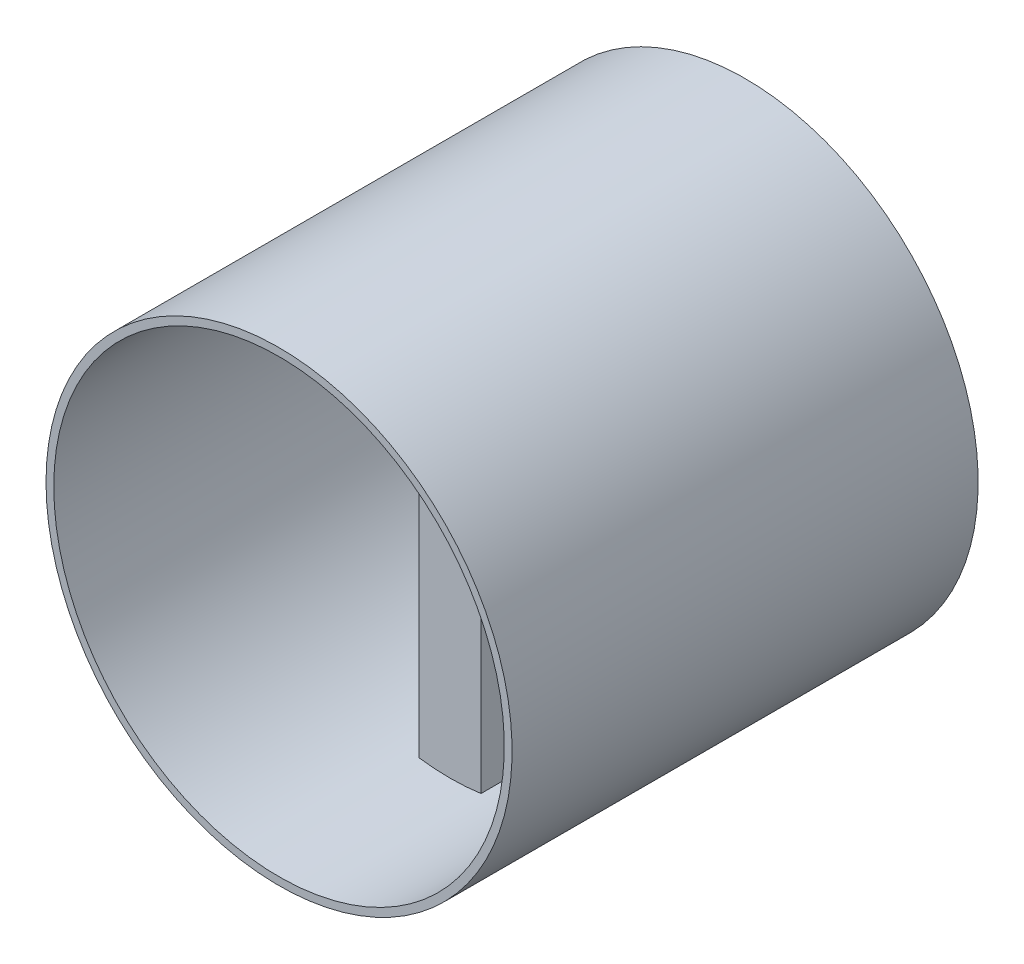
ISO-10303-21;
HEADER;
FILE_DESCRIPTION(('STEP AP214'),'2;1');
FILE_NAME('part.step','',(''),(''),'','','');
FILE_SCHEMA(('AUTOMOTIVE_DESIGN { 1 0 10303 214 1 1 1 1 }'));
ENDSEC;
DATA;
#1=APPLICATION_CONTEXT('core data for automotive mechanical design processes');
#2=APPLICATION_PROTOCOL_DEFINITION('international standard','automotive_design',2000,#1);
#3=PRODUCT_CONTEXT('',#1,'mechanical');
#4=PRODUCT('Part','Part','',(#3));
#5=PRODUCT_RELATED_PRODUCT_CATEGORY('part','',(#4));
#6=PRODUCT_DEFINITION_FORMATION('','',#4);
#7=PRODUCT_DEFINITION_CONTEXT('part definition',#1,'design');
#8=PRODUCT_DEFINITION('design','',#6,#7);
#9=PRODUCT_DEFINITION_SHAPE('','',#8);
#10=(LENGTH_UNIT() NAMED_UNIT(*) SI_UNIT(.MILLI.,.METRE.));
#11=(NAMED_UNIT(*) PLANE_ANGLE_UNIT() SI_UNIT($,.RADIAN.));
#12=(NAMED_UNIT(*) SI_UNIT($,.STERADIAN.) SOLID_ANGLE_UNIT());
#13=UNCERTAINTY_MEASURE_WITH_UNIT(LENGTH_MEASURE(1.E-05),#10,'distance_accuracy_value','');
#14=(GEOMETRIC_REPRESENTATION_CONTEXT(3) GLOBAL_UNCERTAINTY_ASSIGNED_CONTEXT((#13)) GLOBAL_UNIT_ASSIGNED_CONTEXT((#10,
#11,#12)) REPRESENTATION_CONTEXT('',''));
#15=CARTESIAN_POINT('',(0.,0.,0.));
#16=DIRECTION('',(0.,0.,1.));
#17=DIRECTION('',(1.,0.,0.));
#18=AXIS2_PLACEMENT_3D('',#15,#16,#17);
#19=CARTESIAN_POINT('',(0.,0.,60.));
#20=DIRECTION('',(1.,0.,0.));
#21=DIRECTION('',(0.,0.,-1.));
#22=AXIS2_PLACEMENT_3D('',#19,#20,#21);
#23=PLANE('',#22);
#24=DIRECTION('',(0.,-1.,0.));
#25=VECTOR('',#24,1.);
#26=CARTESIAN_POINT('',(0.,0.,38.));
#27=LINE('',#26,#25);
#28=CARTESIAN_POINT('',(0.,58.2228132326902,38.));
#29=VERTEX_POINT('',#28);
#30=CARTESIAN_POINT('',(0.,0.77718676730985,38.));
#31=VERTEX_POINT('',#30);
#32=EDGE_CURVE('E134',#29,#31,#27,.T.);
#33=ORIENTED_EDGE('',*,*,#32,.F.);
#34=DIRECTION('',(0.,0.,-1.));
#35=VECTOR('',#34,1.);
#36=CARTESIAN_POINT('',(0.,58.2228132326901,60.));
#37=LINE('',#36,#35);
#38=CARTESIAN_POINT('',(0.,58.2228132326901,30.));
#39=VERTEX_POINT('',#38);
#40=EDGE_CURVE('E44',#39,#29,#37,.F.);
#41=ORIENTED_EDGE('',*,*,#40,.F.);
#42=DIRECTION('',(0.,1.,0.));
#43=VECTOR('',#42,1.);
#44=CARTESIAN_POINT('',(0.,0.,30.));
#45=LINE('',#44,#43);
#46=CARTESIAN_POINT('',(0.,0.77718676730985,30.));
#47=VERTEX_POINT('',#46);
#48=EDGE_CURVE('E162',#47,#39,#45,.T.);
#49=ORIENTED_EDGE('',*,*,#48,.F.);
#50=DIRECTION('',(0.,0.,-1.));
#51=VECTOR('',#50,1.);
#52=CARTESIAN_POINT('',(0.,0.77718676730985,60.));
#53=LINE('',#52,#51);
#54=EDGE_CURVE('E11',#31,#47,#53,.T.);
#55=ORIENTED_EDGE('',*,*,#54,.F.);
#56=EDGE_LOOP('',(#33,#41,#49,#55));
#57=FACE_BOUND('',#56,.T.);
#58=ADVANCED_FACE('F37',(#57),#23,.F.);
#59=CARTESIAN_POINT('',(8.,0.,60.));
#60=DIRECTION('',(-1.,0.,0.));
#61=DIRECTION('',(0.,-1.,0.));
#62=AXIS2_PLACEMENT_3D('',#59,#60,#61);
#63=PLANE('',#62);
#64=DIRECTION('',(0.,1.,0.));
#65=VECTOR('',#64,1.);
#66=CARTESIAN_POINT('',(8.,0.,38.));
#67=LINE('',#66,#65);
#68=CARTESIAN_POINT('',(8.,0.77718676730985,38.));
#69=VERTEX_POINT('',#68);
#70=CARTESIAN_POINT('',(7.99999999999999,58.2228132326902,38.));
#71=VERTEX_POINT('',#70);
#72=EDGE_CURVE('E124',#69,#71,#67,.T.);
#73=ORIENTED_EDGE('',*,*,#72,.F.);
#74=DIRECTION('',(0.,0.,-1.));
#75=VECTOR('',#74,1.);
#76=CARTESIAN_POINT('',(8.,0.77718676730985,60.));
#77=LINE('',#76,#75);
#78=CARTESIAN_POINT('',(8.,0.77718676730985,30.));
#79=VERTEX_POINT('',#78);
#80=EDGE_CURVE('E148',#79,#69,#77,.F.);
#81=ORIENTED_EDGE('',*,*,#80,.F.);
#82=DIRECTION('',(0.,-1.,0.));
#83=VECTOR('',#82,1.);
#84=CARTESIAN_POINT('',(8.,0.,30.));
#85=LINE('',#84,#83);
#86=CARTESIAN_POINT('',(7.99999999999999,58.2228132326901,30.));
#87=VERTEX_POINT('',#86);
#88=EDGE_CURVE('E147',#87,#79,#85,.T.);
#89=ORIENTED_EDGE('',*,*,#88,.F.);
#90=DIRECTION('',(0.,0.,-1.));
#91=VECTOR('',#90,1.);
#92=CARTESIAN_POINT('',(7.99999999999999,58.2228132326901,60.));
#93=LINE('',#92,#91);
#94=EDGE_CURVE('E141',#71,#87,#93,.T.);
#95=ORIENTED_EDGE('',*,*,#94,.F.);
#96=EDGE_LOOP('',(#73,#81,#89,#95));
#97=FACE_BOUND('',#96,.T.);
#98=ADVANCED_FACE('F146',(#97),#63,.F.);
#99=CARTESIAN_POINT('',(0.,0.,60.));
#100=DIRECTION('',(0.,0.,-1.));
#101=DIRECTION('',(-1.,0.,0.));
#102=AXIS2_PLACEMENT_3D('',#99,#100,#101);
#103=PLANE('',#102);
#104=CARTESIAN_POINT('',(4.,29.5,60.));
#105=DIRECTION('',(0.,0.,-1.));
#106=DIRECTION('',(-1.,0.,0.));
#107=AXIS2_PLACEMENT_3D('',#104,#105,#106);
#108=CIRCLE('',#107,29.);
#109=CARTESIAN_POINT('',(-25.,29.5,60.));
#110=VERTEX_POINT('',#109);
#111=EDGE_CURVE('E156',#110,#110,#108,.T.);
#112=ORIENTED_EDGE('',*,*,#111,.T.);
#113=EDGE_LOOP('',(#112));
#114=FACE_BOUND('',#113,.T.);
#115=CARTESIAN_POINT('',(4.,29.5,60.));
#116=DIRECTION('',(0.,0.,-1.));
#117=DIRECTION('',(-1.,0.,0.));
#118=AXIS2_PLACEMENT_3D('',#115,#116,#117);
#119=CIRCLE('',#118,30.);
#120=CARTESIAN_POINT('',(-26.,29.5,60.));
#121=VERTEX_POINT('',#120);
#122=EDGE_CURVE('E150',#121,#121,#119,.T.);
#123=ORIENTED_EDGE('',*,*,#122,.F.);
#124=EDGE_LOOP('',(#123));
#125=FACE_BOUND('',#124,.T.);
#126=ADVANCED_FACE('F297',(#114,#125),#103,.F.);
#127=CARTESIAN_POINT('',(0.,0.,0.));
#128=DIRECTION('',(0.,0.,-1.));
#129=DIRECTION('',(-1.,0.,0.));
#130=AXIS2_PLACEMENT_3D('',#127,#128,#129);
#131=PLANE('',#130);
#132=CARTESIAN_POINT('',(4.,29.5,0.));
#133=DIRECTION('',(0.,0.,-1.));
#134=DIRECTION('',(-1.,0.,0.));
#135=AXIS2_PLACEMENT_3D('',#132,#133,#134);
#136=CIRCLE('',#135,29.);
#137=CARTESIAN_POINT('',(-25.,29.5,0.));
#138=VERTEX_POINT('',#137);
#139=EDGE_CURVE('E159',#138,#138,#136,.T.);
#140=ORIENTED_EDGE('',*,*,#139,.F.);
#141=EDGE_LOOP('',(#140));
#142=FACE_BOUND('',#141,.T.);
#143=CARTESIAN_POINT('',(4.,29.5,0.));
#144=DIRECTION('',(0.,0.,-1.));
#145=DIRECTION('',(-1.,0.,0.));
#146=AXIS2_PLACEMENT_3D('',#143,#144,#145);
#147=CIRCLE('',#146,30.);
#148=CARTESIAN_POINT('',(-26.,29.5,0.));
#149=VERTEX_POINT('',#148);
#150=EDGE_CURVE('E153',#149,#149,#147,.T.);
#151=ORIENTED_EDGE('',*,*,#150,.T.);
#152=EDGE_LOOP('',(#151));
#153=FACE_BOUND('',#152,.T.);
#154=ADVANCED_FACE('F312',(#142,#153),#131,.T.);
#155=CARTESIAN_POINT('',(4.,29.5,60.));
#156=DIRECTION('',(0.,0.,-1.));
#157=DIRECTION('',(-1.,0.,0.));
#158=AXIS2_PLACEMENT_3D('',#155,#156,#157);
#159=CYLINDRICAL_SURFACE('',#158,29.);
#160=ORIENTED_EDGE('',*,*,#111,.F.);
#161=EDGE_LOOP('',(#160));
#162=FACE_BOUND('',#161,.T.);
#163=CARTESIAN_POINT('',(4.,29.5,38.));
#164=DIRECTION('',(0.,0.,1.));
#165=DIRECTION('',(1.,0.,0.));
#166=AXIS2_PLACEMENT_3D('',#163,#164,#165);
#167=CIRCLE('',#166,29.);
#168=EDGE_CURVE('E129',#31,#69,#167,.T.);
#169=ORIENTED_EDGE('',*,*,#168,.F.);
#170=ORIENTED_EDGE('',*,*,#54,.T.);
#171=CARTESIAN_POINT('',(4.,29.5,30.));
#172=DIRECTION('',(0.,0.,-1.));
#173=DIRECTION('',(-1.,0.,0.));
#174=AXIS2_PLACEMENT_3D('',#171,#172,#173);
#175=CIRCLE('',#174,29.);
#176=EDGE_CURVE('E169',#79,#47,#175,.T.);
#177=ORIENTED_EDGE('',*,*,#176,.F.);
#178=ORIENTED_EDGE('',*,*,#80,.T.);
#179=EDGE_LOOP('',(#169,#170,#177,#178));
#180=FACE_BOUND('',#179,.T.);
#181=ORIENTED_EDGE('',*,*,#40,.T.);
#182=EDGE_CURVE('E127',#71,#29,#167,.T.);
#183=ORIENTED_EDGE('',*,*,#182,.F.);
#184=ORIENTED_EDGE('',*,*,#94,.T.);
#185=EDGE_CURVE('E167',#39,#87,#175,.T.);
#186=ORIENTED_EDGE('',*,*,#185,.F.);
#187=EDGE_LOOP('',(#181,#183,#184,#186));
#188=FACE_BOUND('',#187,.T.);
#189=ORIENTED_EDGE('',*,*,#139,.T.);
#190=EDGE_LOOP('',(#189));
#191=FACE_BOUND('',#190,.T.);
#192=ADVANCED_FACE('F138',(#162,#180,#188,#191),#159,.F.);
#193=CARTESIAN_POINT('',(4.,29.5,60.));
#194=DIRECTION('',(0.,0.,-1.));
#195=DIRECTION('',(-1.,0.,0.));
#196=AXIS2_PLACEMENT_3D('',#193,#194,#195);
#197=CYLINDRICAL_SURFACE('',#196,30.);
#198=ORIENTED_EDGE('',*,*,#122,.T.);
#199=EDGE_LOOP('',(#198));
#200=FACE_BOUND('',#199,.T.);
#201=ORIENTED_EDGE('',*,*,#150,.F.);
#202=EDGE_LOOP('',(#201));
#203=FACE_BOUND('',#202,.T.);
#204=ADVANCED_FACE('F300',(#200,#203),#197,.T.);
#205=CARTESIAN_POINT('',(4.,29.5,30.));
#206=DIRECTION('',(0.,0.,-1.));
#207=DIRECTION('',(-1.,0.,0.));
#208=AXIS2_PLACEMENT_3D('',#205,#206,#207);
#209=PLANE('',#208);
#210=CARTESIAN_POINT('',(4.,29.5,30.));
#211=DIRECTION('',(0.,0.,-1.));
#212=DIRECTION('',(-1.,0.,0.));
#213=AXIS2_PLACEMENT_3D('',#210,#211,#212);
#214=CIRCLE('',#213,3.);
#215=CARTESIAN_POINT('',(6.96725784447476,29.9420190995907,30.));
#216=VERTEX_POINT('',#215);
#217=CARTESIAN_POINT('',(6.96725784447476,29.0579809004093,30.));
#218=VERTEX_POINT('',#217);
#219=EDGE_CURVE('E51',#216,#218,#214,.T.);
#220=ORIENTED_EDGE('',*,*,#219,.F.);
#221=DIRECTION('',(0.0738716855153117,-0.997267754456709,0.));
#222=VECTOR('',#221,1.);
#223=CARTESIAN_POINT('',(6.,43.,30.));
#224=LINE('',#223,#222);
#225=CARTESIAN_POINT('',(6.,43.,30.));
#226=VERTEX_POINT('',#225);
#227=EDGE_CURVE('E187',#226,#216,#224,.T.);
#228=ORIENTED_EDGE('',*,*,#227,.F.);
#229=CARTESIAN_POINT('',(4.,43.,30.));
#230=DIRECTION('',(0.,0.,-1.));
#231=DIRECTION('',(-1.,0.,0.));
#232=AXIS2_PLACEMENT_3D('',#229,#230,#231);
#233=CIRCLE('',#232,2.);
#234=CARTESIAN_POINT('',(2.,43.,30.));
#235=VERTEX_POINT('',#234);
#236=EDGE_CURVE('E191',#235,#226,#233,.T.);
#237=ORIENTED_EDGE('',*,*,#236,.F.);
#238=DIRECTION('',(0.0738716855153117,0.997267754456709,0.));
#239=VECTOR('',#238,1.);
#240=CARTESIAN_POINT('',(1.03274215552524,29.9420190995907,30.));
#241=LINE('',#240,#239);
#242=CARTESIAN_POINT('',(1.03274215552524,29.9420190995907,30.));
#243=VERTEX_POINT('',#242);
#244=EDGE_CURVE('E194',#243,#235,#241,.T.);
#245=ORIENTED_EDGE('',*,*,#244,.F.);
#246=CARTESIAN_POINT('',(4.,29.5,30.));
#247=DIRECTION('',(0.,0.,-1.));
#248=DIRECTION('',(1.,0.,0.));
#249=AXIS2_PLACEMENT_3D('',#246,#247,#248);
#250=CIRCLE('',#249,3.);
#251=CARTESIAN_POINT('',(1.03274215552524,29.0579809004093,30.));
#252=VERTEX_POINT('',#251);
#253=EDGE_CURVE('E197',#252,#243,#250,.T.);
#254=ORIENTED_EDGE('',*,*,#253,.F.);
#255=DIRECTION('',(-0.0738716855153117,0.997267754456709,0.));
#256=VECTOR('',#255,1.);
#257=CARTESIAN_POINT('',(2.,16.,30.));
#258=LINE('',#257,#256);
#259=CARTESIAN_POINT('',(2.,16.,30.));
#260=VERTEX_POINT('',#259);
#261=EDGE_CURVE('E200',#260,#252,#258,.T.);
#262=ORIENTED_EDGE('',*,*,#261,.F.);
#263=CARTESIAN_POINT('',(4.,16.,30.));
#264=DIRECTION('',(0.,0.,-1.));
#265=DIRECTION('',(1.,0.,0.));
#266=AXIS2_PLACEMENT_3D('',#263,#264,#265);
#267=CIRCLE('',#266,2.);
#268=CARTESIAN_POINT('',(6.,16.,30.));
#269=VERTEX_POINT('',#268);
#270=EDGE_CURVE('E203',#269,#260,#267,.T.);
#271=ORIENTED_EDGE('',*,*,#270,.F.);
#272=DIRECTION('',(-0.0738716855153117,-0.997267754456709,0.));
#273=VECTOR('',#272,1.);
#274=CARTESIAN_POINT('',(6.,16.,30.));
#275=LINE('',#274,#273);
#276=EDGE_CURVE('E206',#218,#269,#275,.T.);
#277=ORIENTED_EDGE('',*,*,#276,.F.);
#278=EDGE_LOOP('',(#220,#228,#237,#245,#254,#262,#271,#277));
#279=FACE_BOUND('',#278,.T.);
#280=ORIENTED_EDGE('',*,*,#48,.T.);
#281=ORIENTED_EDGE('',*,*,#185,.T.);
#282=ORIENTED_EDGE('',*,*,#88,.T.);
#283=ORIENTED_EDGE('',*,*,#176,.T.);
#284=EDGE_LOOP('',(#280,#281,#282,#283));
#285=FACE_BOUND('',#284,.T.);
#286=ADVANCED_FACE('F281',(#279,#285),#209,.T.);
#287=CARTESIAN_POINT('',(4.,29.5,31.5));
#288=DIRECTION('',(0.,0.,-1.));
#289=DIRECTION('',(-1.,0.,0.));
#290=AXIS2_PLACEMENT_3D('',#287,#288,#289);
#291=CYLINDRICAL_SURFACE('',#290,3.);
#292=ORIENTED_EDGE('',*,*,#219,.T.);
#293=DIRECTION('',(0.,0.,-1.));
#294=VECTOR('',#293,1.);
#295=CARTESIAN_POINT('',(6.96725784447476,29.0579809004093,31.5));
#296=LINE('',#295,#294);
#297=CARTESIAN_POINT('',(6.96725784447476,29.0579809004093,31.5));
#298=VERTEX_POINT('',#297);
#299=EDGE_CURVE('E170',#298,#218,#296,.T.);
#300=ORIENTED_EDGE('',*,*,#299,.F.);
#301=CARTESIAN_POINT('',(4.,29.5,31.5));
#302=DIRECTION('',(0.,0.,-1.));
#303=DIRECTION('',(-1.,0.,0.));
#304=AXIS2_PLACEMENT_3D('',#301,#302,#303);
#305=CIRCLE('',#304,3.);
#306=CARTESIAN_POINT('',(6.96725784447476,29.9420190995907,31.5));
#307=VERTEX_POINT('',#306);
#308=EDGE_CURVE('E190',#307,#298,#305,.T.);
#309=ORIENTED_EDGE('',*,*,#308,.F.);
#310=DIRECTION('',(0.,0.,-1.));
#311=VECTOR('',#310,1.);
#312=CARTESIAN_POINT('',(6.96725784447476,29.9420190995907,31.5));
#313=LINE('',#312,#311);
#314=EDGE_CURVE('E185',#307,#216,#313,.T.);
#315=ORIENTED_EDGE('',*,*,#314,.T.);
#316=EDGE_LOOP('',(#292,#300,#309,#315));
#317=FACE_BOUND('',#316,.T.);
#318=ADVANCED_FACE('F255',(#317),#291,.F.);
#319=CARTESIAN_POINT('',(6.,43.,31.5));
#320=DIRECTION('',(0.997267754456709,0.0738716855153117,0.));
#321=DIRECTION('',(-0.0738716855153117,0.997267754456709,0.));
#322=AXIS2_PLACEMENT_3D('',#319,#320,#321);
#323=PLANE('',#322);
#324=ORIENTED_EDGE('',*,*,#227,.T.);
#325=ORIENTED_EDGE('',*,*,#314,.F.);
#326=DIRECTION('',(0.0738716855153117,-0.997267754456709,0.));
#327=VECTOR('',#326,1.);
#328=CARTESIAN_POINT('',(6.,43.,31.5));
#329=LINE('',#328,#327);
#330=CARTESIAN_POINT('',(6.,43.,31.5));
#331=VERTEX_POINT('',#330);
#332=EDGE_CURVE('E173',#331,#307,#329,.T.);
#333=ORIENTED_EDGE('',*,*,#332,.F.);
#334=DIRECTION('',(0.,0.,-1.));
#335=VECTOR('',#334,1.);
#336=CARTESIAN_POINT('',(6.,43.,31.5));
#337=LINE('',#336,#335);
#338=EDGE_CURVE('E183',#331,#226,#337,.T.);
#339=ORIENTED_EDGE('',*,*,#338,.T.);
#340=EDGE_LOOP('',(#324,#325,#333,#339));
#341=FACE_BOUND('',#340,.T.);
#342=ADVANCED_FACE('F277',(#341),#323,.F.);
#343=CARTESIAN_POINT('',(4.,43.,31.5));
#344=DIRECTION('',(0.,0.,-1.));
#345=DIRECTION('',(-1.,0.,0.));
#346=AXIS2_PLACEMENT_3D('',#343,#344,#345);
#347=CYLINDRICAL_SURFACE('',#346,2.);
#348=ORIENTED_EDGE('',*,*,#236,.T.);
#349=ORIENTED_EDGE('',*,*,#338,.F.);
#350=CARTESIAN_POINT('',(4.,43.,31.5));
#351=DIRECTION('',(0.,0.,-1.));
#352=DIRECTION('',(-1.,0.,0.));
#353=AXIS2_PLACEMENT_3D('',#350,#351,#352);
#354=CIRCLE('',#353,2.);
#355=CARTESIAN_POINT('',(2.,43.,31.5));
#356=VERTEX_POINT('',#355);
#357=EDGE_CURVE('E212',#356,#331,#354,.T.);
#358=ORIENTED_EDGE('',*,*,#357,.F.);
#359=DIRECTION('',(0.,0.,-1.));
#360=VECTOR('',#359,1.);
#361=CARTESIAN_POINT('',(2.,43.,31.5));
#362=LINE('',#361,#360);
#363=EDGE_CURVE('E181',#356,#235,#362,.T.);
#364=ORIENTED_EDGE('',*,*,#363,.T.);
#365=EDGE_LOOP('',(#348,#349,#358,#364));
#366=FACE_BOUND('',#365,.T.);
#367=ADVANCED_FACE('F283',(#366),#347,.F.);
#368=CARTESIAN_POINT('',(1.03274215552524,29.9420190995907,31.5));
#369=DIRECTION('',(-0.997267754456709,0.0738716855153117,0.));
#370=DIRECTION('',(-0.0738716855153117,-0.997267754456709,0.));
#371=AXIS2_PLACEMENT_3D('',#368,#369,#370);
#372=PLANE('',#371);
#373=ORIENTED_EDGE('',*,*,#244,.T.);
#374=ORIENTED_EDGE('',*,*,#363,.F.);
#375=DIRECTION('',(0.0738716855153117,0.997267754456709,0.));
#376=VECTOR('',#375,1.);
#377=CARTESIAN_POINT('',(1.03274215552524,29.9420190995907,31.5));
#378=LINE('',#377,#376);
#379=CARTESIAN_POINT('',(1.03274215552524,29.9420190995907,31.5));
#380=VERTEX_POINT('',#379);
#381=EDGE_CURVE('E215',#380,#356,#378,.T.);
#382=ORIENTED_EDGE('',*,*,#381,.F.);
#383=DIRECTION('',(0.,0.,-1.));
#384=VECTOR('',#383,1.);
#385=CARTESIAN_POINT('',(1.03274215552524,29.9420190995907,31.5));
#386=LINE('',#385,#384);
#387=EDGE_CURVE('E179',#380,#243,#386,.T.);
#388=ORIENTED_EDGE('',*,*,#387,.T.);
#389=EDGE_LOOP('',(#373,#374,#382,#388));
#390=FACE_BOUND('',#389,.T.);
#391=ADVANCED_FACE('F273',(#390),#372,.F.);
#392=CARTESIAN_POINT('',(4.,29.5,31.5));
#393=DIRECTION('',(0.,0.,-1.));
#394=DIRECTION('',(-1.,0.,0.));
#395=AXIS2_PLACEMENT_3D('',#392,#393,#394);
#396=CYLINDRICAL_SURFACE('',#395,3.);
#397=ORIENTED_EDGE('',*,*,#253,.T.);
#398=ORIENTED_EDGE('',*,*,#387,.F.);
#399=CARTESIAN_POINT('',(4.,29.5,31.5));
#400=DIRECTION('',(0.,0.,-1.));
#401=DIRECTION('',(1.,0.,0.));
#402=AXIS2_PLACEMENT_3D('',#399,#400,#401);
#403=CIRCLE('',#402,3.);
#404=CARTESIAN_POINT('',(1.03274215552524,29.0579809004093,31.5));
#405=VERTEX_POINT('',#404);
#406=EDGE_CURVE('E218',#405,#380,#403,.T.);
#407=ORIENTED_EDGE('',*,*,#406,.F.);
#408=DIRECTION('',(0.,0.,-1.));
#409=VECTOR('',#408,1.);
#410=CARTESIAN_POINT('',(1.03274215552524,29.0579809004093,31.5));
#411=LINE('',#410,#409);
#412=EDGE_CURVE('E177',#405,#252,#411,.T.);
#413=ORIENTED_EDGE('',*,*,#412,.T.);
#414=EDGE_LOOP('',(#397,#398,#407,#413));
#415=FACE_BOUND('',#414,.T.);
#416=ADVANCED_FACE('F269',(#415),#396,.F.);
#417=CARTESIAN_POINT('',(2.,16.,31.5));
#418=DIRECTION('',(-0.997267754456709,-0.0738716855153117,0.));
#419=DIRECTION('',(0.0738716855153117,-0.997267754456709,0.));
#420=AXIS2_PLACEMENT_3D('',#417,#418,#419);
#421=PLANE('',#420);
#422=ORIENTED_EDGE('',*,*,#261,.T.);
#423=ORIENTED_EDGE('',*,*,#412,.F.);
#424=DIRECTION('',(-0.0738716855153117,0.997267754456709,0.));
#425=VECTOR('',#424,1.);
#426=CARTESIAN_POINT('',(2.,16.,31.5));
#427=LINE('',#426,#425);
#428=CARTESIAN_POINT('',(2.,16.,31.5));
#429=VERTEX_POINT('',#428);
#430=EDGE_CURVE('E221',#429,#405,#427,.T.);
#431=ORIENTED_EDGE('',*,*,#430,.F.);
#432=DIRECTION('',(0.,0.,-1.));
#433=VECTOR('',#432,1.);
#434=CARTESIAN_POINT('',(2.,16.,31.5));
#435=LINE('',#434,#433);
#436=EDGE_CURVE('E175',#429,#260,#435,.T.);
#437=ORIENTED_EDGE('',*,*,#436,.T.);
#438=EDGE_LOOP('',(#422,#423,#431,#437));
#439=FACE_BOUND('',#438,.T.);
#440=ADVANCED_FACE('F265',(#439),#421,.F.);
#441=CARTESIAN_POINT('',(4.,16.,31.5));
#442=DIRECTION('',(0.,0.,-1.));
#443=DIRECTION('',(-1.,0.,0.));
#444=AXIS2_PLACEMENT_3D('',#441,#442,#443);
#445=CYLINDRICAL_SURFACE('',#444,2.);
#446=ORIENTED_EDGE('',*,*,#270,.T.);
#447=ORIENTED_EDGE('',*,*,#436,.F.);
#448=CARTESIAN_POINT('',(4.,16.,31.5));
#449=DIRECTION('',(0.,0.,-1.));
#450=DIRECTION('',(1.,0.,0.));
#451=AXIS2_PLACEMENT_3D('',#448,#449,#450);
#452=CIRCLE('',#451,2.);
#453=CARTESIAN_POINT('',(6.,16.,31.5));
#454=VERTEX_POINT('',#453);
#455=EDGE_CURVE('E224',#454,#429,#452,.T.);
#456=ORIENTED_EDGE('',*,*,#455,.F.);
#457=DIRECTION('',(0.,0.,-1.));
#458=VECTOR('',#457,1.);
#459=CARTESIAN_POINT('',(6.,16.,31.5));
#460=LINE('',#459,#458);
#461=EDGE_CURVE('E172',#454,#269,#460,.T.);
#462=ORIENTED_EDGE('',*,*,#461,.T.);
#463=EDGE_LOOP('',(#446,#447,#456,#462));
#464=FACE_BOUND('',#463,.T.);
#465=ADVANCED_FACE('F261',(#464),#445,.F.);
#466=CARTESIAN_POINT('',(6.,16.,31.5));
#467=DIRECTION('',(0.997267754456709,-0.0738716855153117,0.));
#468=DIRECTION('',(0.0738716855153117,0.997267754456709,0.));
#469=AXIS2_PLACEMENT_3D('',#466,#467,#468);
#470=PLANE('',#469);
#471=ORIENTED_EDGE('',*,*,#276,.T.);
#472=ORIENTED_EDGE('',*,*,#461,.F.);
#473=DIRECTION('',(-0.0738716855153117,-0.997267754456709,0.));
#474=VECTOR('',#473,1.);
#475=CARTESIAN_POINT('',(6.,16.,31.5));
#476=LINE('',#475,#474);
#477=EDGE_CURVE('E227',#298,#454,#476,.T.);
#478=ORIENTED_EDGE('',*,*,#477,.F.);
#479=ORIENTED_EDGE('',*,*,#299,.T.);
#480=EDGE_LOOP('',(#471,#472,#478,#479));
#481=FACE_BOUND('',#480,.T.);
#482=ADVANCED_FACE('F250',(#481),#470,.F.);
#483=CARTESIAN_POINT('',(4.,29.5,31.5));
#484=DIRECTION('',(0.,0.,-1.));
#485=DIRECTION('',(-1.,0.,0.));
#486=AXIS2_PLACEMENT_3D('',#483,#484,#485);
#487=PLANE('',#486);
#488=CARTESIAN_POINT('',(4.,29.5,31.5));
#489=DIRECTION('',(0.,0.,-1.));
#490=DIRECTION('',(-1.,0.,0.));
#491=AXIS2_PLACEMENT_3D('',#488,#489,#490);
#492=CIRCLE('',#491,2.);
#493=CARTESIAN_POINT('',(2.,29.5,31.5));
#494=VERTEX_POINT('',#493);
#495=EDGE_CURVE('E233',#494,#494,#492,.T.);
#496=ORIENTED_EDGE('',*,*,#495,.F.);
#497=EDGE_LOOP('',(#496));
#498=FACE_BOUND('',#497,.T.);
#499=ORIENTED_EDGE('',*,*,#308,.T.);
#500=ORIENTED_EDGE('',*,*,#477,.T.);
#501=ORIENTED_EDGE('',*,*,#455,.T.);
#502=ORIENTED_EDGE('',*,*,#430,.T.);
#503=ORIENTED_EDGE('',*,*,#406,.T.);
#504=ORIENTED_EDGE('',*,*,#381,.T.);
#505=ORIENTED_EDGE('',*,*,#357,.T.);
#506=ORIENTED_EDGE('',*,*,#332,.T.);
#507=EDGE_LOOP('',(#499,#500,#501,#502,#503,#504,#505,#506));
#508=FACE_BOUND('',#507,.T.);
#509=ADVANCED_FACE('F247',(#498,#508),#487,.T.);
#510=CARTESIAN_POINT('',(4.,29.5,38.));
#511=DIRECTION('',(0.,0.,1.));
#512=DIRECTION('',(1.,0.,0.));
#513=AXIS2_PLACEMENT_3D('',#510,#511,#512);
#514=PLANE('',#513);
#515=CARTESIAN_POINT('',(4.,29.5,38.));
#516=DIRECTION('',(0.,0.,-1.));
#517=DIRECTION('',(-1.,0.,0.));
#518=AXIS2_PLACEMENT_3D('',#515,#516,#517);
#519=CIRCLE('',#518,2.);
#520=CARTESIAN_POINT('',(2.,29.5,38.));
#521=VERTEX_POINT('',#520);
#522=EDGE_CURVE('E236',#521,#521,#519,.T.);
#523=ORIENTED_EDGE('',*,*,#522,.T.);
#524=EDGE_LOOP('',(#523));
#525=FACE_BOUND('',#524,.T.);
#526=ORIENTED_EDGE('',*,*,#32,.T.);
#527=ORIENTED_EDGE('',*,*,#168,.T.);
#528=ORIENTED_EDGE('',*,*,#72,.T.);
#529=ORIENTED_EDGE('',*,*,#182,.T.);
#530=EDGE_LOOP('',(#526,#527,#528,#529));
#531=FACE_BOUND('',#530,.T.);
#532=ADVANCED_FACE('F126',(#525,#531),#514,.T.);
#533=CARTESIAN_POINT('',(4.,29.5,38.));
#534=DIRECTION('',(0.,0.,-1.));
#535=DIRECTION('',(-1.,0.,0.));
#536=AXIS2_PLACEMENT_3D('',#533,#534,#535);
#537=CYLINDRICAL_SURFACE('',#536,2.);
#538=ORIENTED_EDGE('',*,*,#522,.F.);
#539=EDGE_LOOP('',(#538));
#540=FACE_BOUND('',#539,.T.);
#541=ORIENTED_EDGE('',*,*,#495,.T.);
#542=EDGE_LOOP('',(#541));
#543=FACE_BOUND('',#542,.T.);
#544=ADVANCED_FACE('F241',(#540,#543),#537,.F.);
#545=CLOSED_SHELL('',(#58,#98,#126,#154,#192,#204,#286,#318,#342,#367,#391,#416,#440,#465,#482,
#509,#532,#544));
#546=MANIFOLD_SOLID_BREP('B2',#545);
#547=ADVANCED_BREP_SHAPE_REPRESENTATION('',(#18,#546),#14);
#548=SHAPE_DEFINITION_REPRESENTATION(#9,#547);
ENDSEC;
END-ISO-10303-21;
